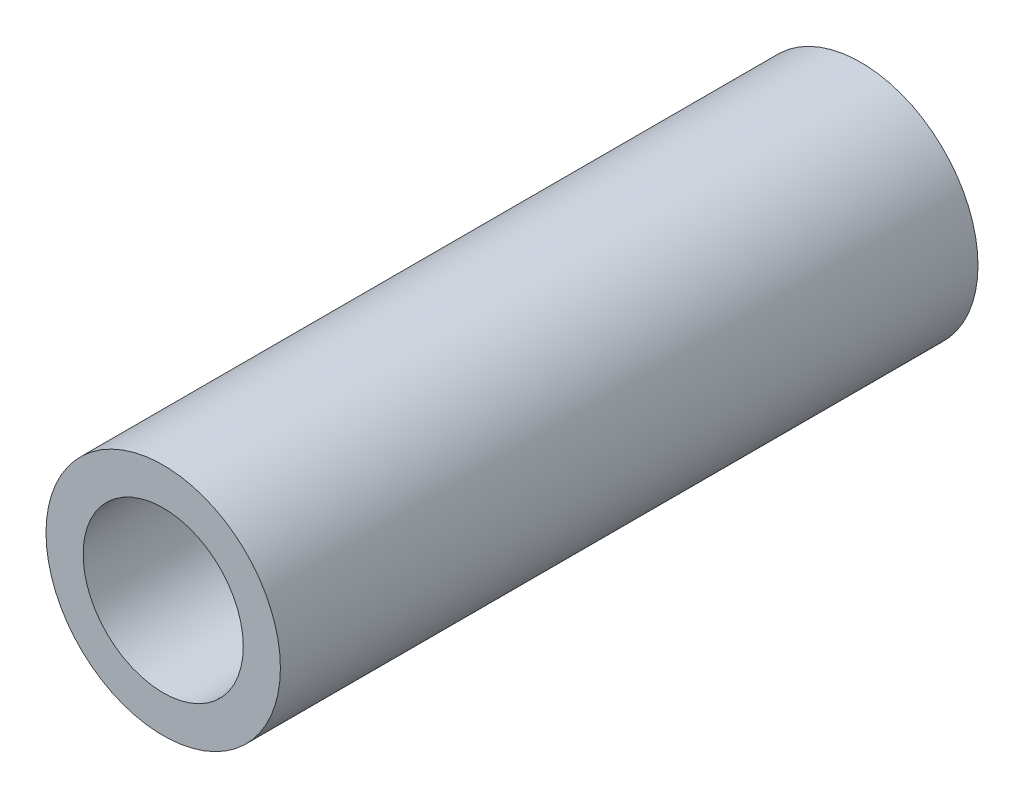
ISO-10303-21;
HEADER;
FILE_DESCRIPTION(('STEP AP214'),'2;1');
FILE_NAME('part.step','',(''),(''),'','','');
FILE_SCHEMA(('AUTOMOTIVE_DESIGN { 1 0 10303 214 1 1 1 1 }'));
ENDSEC;
DATA;
#1=APPLICATION_CONTEXT('core data for automotive mechanical design processes');
#2=APPLICATION_PROTOCOL_DEFINITION('international standard','automotive_design',2000,#1);
#3=PRODUCT_CONTEXT('',#1,'mechanical');
#4=PRODUCT('Part','Part','',(#3));
#5=PRODUCT_RELATED_PRODUCT_CATEGORY('part','',(#4));
#6=PRODUCT_DEFINITION_FORMATION('','',#4);
#7=PRODUCT_DEFINITION_CONTEXT('part definition',#1,'design');
#8=PRODUCT_DEFINITION('design','',#6,#7);
#9=PRODUCT_DEFINITION_SHAPE('','',#8);
#10=(LENGTH_UNIT() NAMED_UNIT(*) SI_UNIT(.MILLI.,.METRE.));
#11=(NAMED_UNIT(*) PLANE_ANGLE_UNIT() SI_UNIT($,.RADIAN.));
#12=(NAMED_UNIT(*) SI_UNIT($,.STERADIAN.) SOLID_ANGLE_UNIT());
#13=UNCERTAINTY_MEASURE_WITH_UNIT(LENGTH_MEASURE(1.E-05),#10,'distance_accuracy_value','');
#14=(GEOMETRIC_REPRESENTATION_CONTEXT(3) GLOBAL_UNCERTAINTY_ASSIGNED_CONTEXT((#13)) GLOBAL_UNIT_ASSIGNED_CONTEXT((#10,
#11,#12)) REPRESENTATION_CONTEXT('',''));
#15=CARTESIAN_POINT('',(0.,0.,0.));
#16=DIRECTION('',(0.,0.,1.));
#17=DIRECTION('',(1.,0.,0.));
#18=AXIS2_PLACEMENT_3D('',#15,#16,#17);
#19=CARTESIAN_POINT('',(0.,0.,63.5));
#20=DIRECTION('',(0.,0.,1.));
#21=DIRECTION('',(1.,0.,0.));
#22=AXIS2_PLACEMENT_3D('',#19,#20,#21);
#23=PLANE('',#22);
#24=CARTESIAN_POINT('',(0.,0.,63.5));
#25=DIRECTION('',(0.,0.,1.));
#26=DIRECTION('',(1.,0.,0.));
#27=AXIS2_PLACEMENT_3D('',#24,#25,#26);
#28=CIRCLE('',#27,10.668);
#29=CARTESIAN_POINT('',(10.668,0.,63.5));
#30=VERTEX_POINT('',#29);
#31=EDGE_CURVE('E10',#30,#30,#28,.T.);
#32=ORIENTED_EDGE('',*,*,#31,.T.);
#33=EDGE_LOOP('',(#32));
#34=FACE_BOUND('',#33,.T.);
#35=CARTESIAN_POINT('',(0.,0.,63.5));
#36=DIRECTION('',(0.,0.,1.));
#37=DIRECTION('',(1.,0.,0.));
#38=AXIS2_PLACEMENT_3D('',#35,#36,#37);
#39=CIRCLE('',#38,7.2898);
#40=CARTESIAN_POINT('',(7.2898,0.,63.5));
#41=VERTEX_POINT('',#40);
#42=EDGE_CURVE('E44',#41,#41,#39,.T.);
#43=ORIENTED_EDGE('',*,*,#42,.F.);
#44=EDGE_LOOP('',(#43));
#45=FACE_BOUND('',#44,.T.);
#46=ADVANCED_FACE('F33',(#34,#45),#23,.T.);
#47=CARTESIAN_POINT('',(0.,0.,0.));
#48=DIRECTION('',(0.,0.,1.));
#49=DIRECTION('',(1.,0.,0.));
#50=AXIS2_PLACEMENT_3D('',#47,#48,#49);
#51=PLANE('',#50);
#52=CARTESIAN_POINT('',(0.,0.,0.));
#53=DIRECTION('',(0.,0.,1.));
#54=DIRECTION('',(1.,0.,0.));
#55=AXIS2_PLACEMENT_3D('',#52,#53,#54);
#56=CIRCLE('',#55,10.668);
#57=CARTESIAN_POINT('',(10.668,0.,0.));
#58=VERTEX_POINT('',#57);
#59=EDGE_CURVE('E37',#58,#58,#56,.T.);
#60=ORIENTED_EDGE('',*,*,#59,.F.);
#61=EDGE_LOOP('',(#60));
#62=FACE_BOUND('',#61,.T.);
#63=CARTESIAN_POINT('',(0.,0.,0.));
#64=DIRECTION('',(0.,0.,1.));
#65=DIRECTION('',(1.,0.,0.));
#66=AXIS2_PLACEMENT_3D('',#63,#64,#65);
#67=CIRCLE('',#66,7.2898);
#68=CARTESIAN_POINT('',(7.2898,0.,0.));
#69=VERTEX_POINT('',#68);
#70=EDGE_CURVE('E46',#69,#69,#67,.T.);
#71=ORIENTED_EDGE('',*,*,#70,.T.);
#72=EDGE_LOOP('',(#71));
#73=FACE_BOUND('',#72,.T.);
#74=ADVANCED_FACE('F56',(#62,#73),#51,.F.);
#75=CARTESIAN_POINT('',(0.,0.,63.5));
#76=DIRECTION('',(0.,0.,-1.));
#77=DIRECTION('',(-1.,0.,0.));
#78=AXIS2_PLACEMENT_3D('',#75,#76,#77);
#79=CYLINDRICAL_SURFACE('',#78,10.668);
#80=ORIENTED_EDGE('',*,*,#31,.F.);
#81=EDGE_LOOP('',(#80));
#82=FACE_BOUND('',#81,.T.);
#83=ORIENTED_EDGE('',*,*,#59,.T.);
#84=EDGE_LOOP('',(#83));
#85=FACE_BOUND('',#84,.T.);
#86=ADVANCED_FACE('F35',(#82,#85),#79,.T.);
#87=CARTESIAN_POINT('',(0.,0.,63.5));
#88=DIRECTION('',(0.,0.,-1.));
#89=DIRECTION('',(-1.,0.,0.));
#90=AXIS2_PLACEMENT_3D('',#87,#88,#89);
#91=CYLINDRICAL_SURFACE('',#90,7.2898);
#92=ORIENTED_EDGE('',*,*,#42,.T.);
#93=EDGE_LOOP('',(#92));
#94=FACE_BOUND('',#93,.T.);
#95=ORIENTED_EDGE('',*,*,#70,.F.);
#96=EDGE_LOOP('',(#95));
#97=FACE_BOUND('',#96,.T.);
#98=ADVANCED_FACE('F52',(#94,#97),#91,.F.);
#99=CLOSED_SHELL('',(#46,#74,#86,#98));
#100=MANIFOLD_SOLID_BREP('B2',#99);
#101=ADVANCED_BREP_SHAPE_REPRESENTATION('',(#18,#100),#14);
#102=SHAPE_DEFINITION_REPRESENTATION(#9,#101);
ENDSEC;
END-ISO-10303-21;
